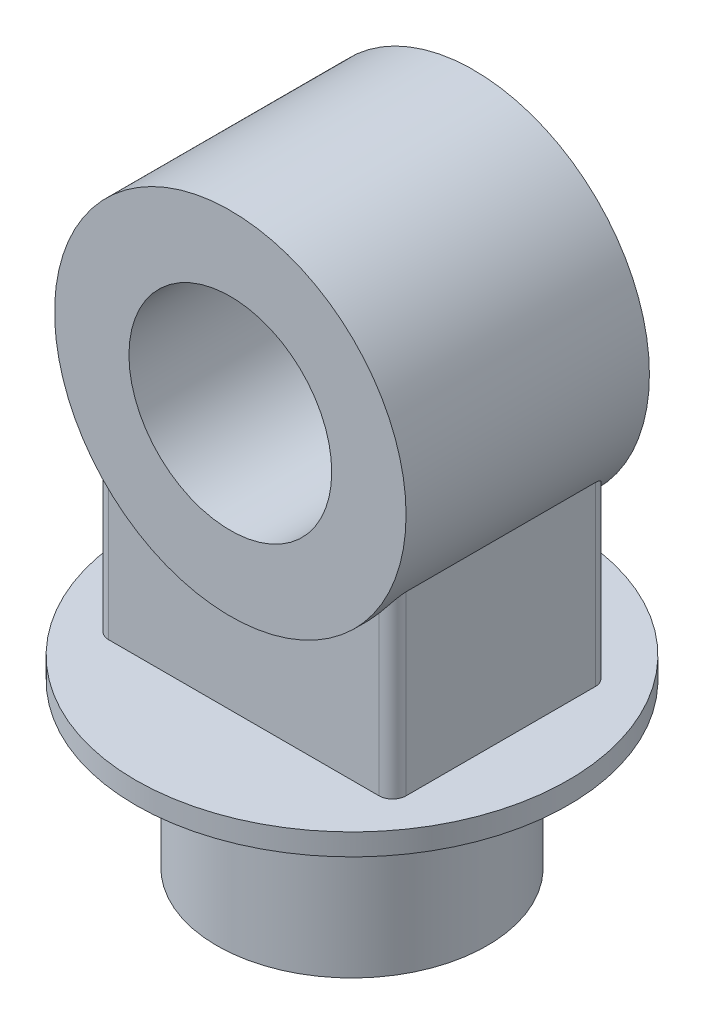
ISO-10303-21;
HEADER;
FILE_DESCRIPTION(('STEP AP214'),'2;1');
FILE_NAME('part.step','',(''),(''),'','','');
FILE_SCHEMA(('AUTOMOTIVE_DESIGN { 1 0 10303 214 1 1 1 1 }'));
ENDSEC;
DATA;
#1=APPLICATION_CONTEXT('core data for automotive mechanical design processes');
#2=APPLICATION_PROTOCOL_DEFINITION('international standard','automotive_design',2000,#1);
#3=PRODUCT_CONTEXT('',#1,'mechanical');
#4=PRODUCT('Part','Part','',(#3));
#5=PRODUCT_RELATED_PRODUCT_CATEGORY('part','',(#4));
#6=PRODUCT_DEFINITION_FORMATION('','',#4);
#7=PRODUCT_DEFINITION_CONTEXT('part definition',#1,'design');
#8=PRODUCT_DEFINITION('design','',#6,#7);
#9=PRODUCT_DEFINITION_SHAPE('','',#8);
#10=(LENGTH_UNIT() NAMED_UNIT(*) SI_UNIT(.MILLI.,.METRE.));
#11=(NAMED_UNIT(*) PLANE_ANGLE_UNIT() SI_UNIT($,.RADIAN.));
#12=(NAMED_UNIT(*) SI_UNIT($,.STERADIAN.) SOLID_ANGLE_UNIT());
#13=UNCERTAINTY_MEASURE_WITH_UNIT(LENGTH_MEASURE(1.E-05),#10,'distance_accuracy_value','');
#14=(GEOMETRIC_REPRESENTATION_CONTEXT(3) GLOBAL_UNCERTAINTY_ASSIGNED_CONTEXT((#13)) GLOBAL_UNIT_ASSIGNED_CONTEXT((#10,
#11,#12)) REPRESENTATION_CONTEXT('',''));
#15=CARTESIAN_POINT('',(0.,0.,0.));
#16=DIRECTION('',(0.,0.,1.));
#17=DIRECTION('',(1.,0.,0.));
#18=AXIS2_PLACEMENT_3D('',#15,#16,#17);
#19=CARTESIAN_POINT('',(0.,120.,0.));
#20=DIRECTION('',(0.,-1.,0.));
#21=DIRECTION('',(0.,0.,-1.));
#22=AXIS2_PLACEMENT_3D('',#19,#20,#21);
#23=CYLINDRICAL_SURFACE('',#22,100.);
#24=CARTESIAN_POINT('',(0.,120.,0.));
#25=DIRECTION('',(0.,1.,0.));
#26=DIRECTION('',(0.,0.,1.));
#27=AXIS2_PLACEMENT_3D('',#24,#25,#26);
#28=CIRCLE('',#27,100.);
#29=CARTESIAN_POINT('',(0.,120.,100.));
#30=VERTEX_POINT('',#29);
#31=EDGE_CURVE('E154',#30,#30,#28,.T.);
#32=ORIENTED_EDGE('',*,*,#31,.F.);
#33=EDGE_LOOP('',(#32));
#34=FACE_BOUND('',#33,.T.);
#35=CARTESIAN_POINT('',(0.,0.,0.));
#36=DIRECTION('',(0.,1.,0.));
#37=DIRECTION('',(0.,0.,1.));
#38=AXIS2_PLACEMENT_3D('',#35,#36,#37);
#39=CIRCLE('',#38,100.);
#40=CARTESIAN_POINT('',(0.,0.,100.));
#41=VERTEX_POINT('',#40);
#42=EDGE_CURVE('E247',#41,#41,#39,.T.);
#43=ORIENTED_EDGE('',*,*,#42,.T.);
#44=EDGE_LOOP('',(#43));
#45=FACE_BOUND('',#44,.T.);
#46=ADVANCED_FACE('F47',(#34,#45),#23,.T.);
#47=CARTESIAN_POINT('',(0.,0.,0.));
#48=DIRECTION('',(0.,1.,0.));
#49=DIRECTION('',(0.,0.,1.));
#50=AXIS2_PLACEMENT_3D('',#47,#48,#49);
#51=PLANE('',#50);
#52=ORIENTED_EDGE('',*,*,#42,.F.);
#53=EDGE_LOOP('',(#52));
#54=FACE_BOUND('',#53,.T.);
#55=ADVANCED_FACE('F259',(#54),#51,.F.);
#56=CARTESIAN_POINT('',(0.,136.,0.));
#57=DIRECTION('',(0.,-1.,0.));
#58=DIRECTION('',(0.,0.,-1.));
#59=AXIS2_PLACEMENT_3D('',#56,#57,#58);
#60=CYLINDRICAL_SURFACE('',#59,160.);
#61=CARTESIAN_POINT('',(0.,136.,0.));
#62=DIRECTION('',(0.,1.,0.));
#63=DIRECTION('',(0.,0.,1.));
#64=AXIS2_PLACEMENT_3D('',#61,#62,#63);
#65=CIRCLE('',#64,160.);
#66=CARTESIAN_POINT('',(0.,136.,160.));
#67=VERTEX_POINT('',#66);
#68=EDGE_CURVE('E243',#67,#67,#65,.T.);
#69=ORIENTED_EDGE('',*,*,#68,.F.);
#70=EDGE_LOOP('',(#69));
#71=FACE_BOUND('',#70,.T.);
#72=CARTESIAN_POINT('',(0.,120.,0.));
#73=DIRECTION('',(0.,1.,0.));
#74=DIRECTION('',(0.,0.,1.));
#75=AXIS2_PLACEMENT_3D('',#72,#73,#74);
#76=CIRCLE('',#75,160.);
#77=CARTESIAN_POINT('',(0.,120.,160.));
#78=VERTEX_POINT('',#77);
#79=EDGE_CURVE('E248',#78,#78,#76,.T.);
#80=ORIENTED_EDGE('',*,*,#79,.T.);
#81=EDGE_LOOP('',(#80));
#82=FACE_BOUND('',#81,.T.);
#83=ADVANCED_FACE('F261',(#71,#82),#60,.T.);
#84=CARTESIAN_POINT('',(0.,136.,0.));
#85=DIRECTION('',(0.,1.,0.));
#86=DIRECTION('',(0.,0.,1.));
#87=AXIS2_PLACEMENT_3D('',#84,#85,#86);
#88=PLANE('',#87);
#89=DIRECTION('',(0.,0.,-1.));
#90=VECTOR('',#89,1.);
#91=CARTESIAN_POINT('',(110.,136.,80.));
#92=LINE('',#91,#90);
#93=CARTESIAN_POINT('',(110.,136.,70.));
#94=VERTEX_POINT('',#93);
#95=CARTESIAN_POINT('',(110.,136.,-70.));
#96=VERTEX_POINT('',#95);
#97=EDGE_CURVE('E219',#94,#96,#92,.T.);
#98=ORIENTED_EDGE('',*,*,#97,.F.);
#99=CARTESIAN_POINT('',(100.,136.,70.));
#100=DIRECTION('',(0.,1.,0.));
#101=DIRECTION('',(0.,0.,1.));
#102=AXIS2_PLACEMENT_3D('',#99,#100,#101);
#103=CIRCLE('',#102,10.);
#104=CARTESIAN_POINT('',(100.,136.,80.));
#105=VERTEX_POINT('',#104);
#106=EDGE_CURVE('E132',#94,#105,#103,.F.);
#107=ORIENTED_EDGE('',*,*,#106,.T.);
#108=DIRECTION('',(1.,0.,0.));
#109=VECTOR('',#108,1.);
#110=CARTESIAN_POINT('',(-110.,136.,80.));
#111=LINE('',#110,#109);
#112=CARTESIAN_POINT('',(-100.,136.,80.));
#113=VERTEX_POINT('',#112);
#114=EDGE_CURVE('E217',#113,#105,#111,.T.);
#115=ORIENTED_EDGE('',*,*,#114,.F.);
#116=CARTESIAN_POINT('',(-100.,136.,70.));
#117=DIRECTION('',(0.,1.,0.));
#118=DIRECTION('',(0.,0.,1.));
#119=AXIS2_PLACEMENT_3D('',#116,#117,#118);
#120=CIRCLE('',#119,10.);
#121=CARTESIAN_POINT('',(-110.,136.,70.));
#122=VERTEX_POINT('',#121);
#123=EDGE_CURVE('E62',#113,#122,#120,.F.);
#124=ORIENTED_EDGE('',*,*,#123,.T.);
#125=DIRECTION('',(0.,0.,1.));
#126=VECTOR('',#125,1.);
#127=CARTESIAN_POINT('',(-110.,136.,80.));
#128=LINE('',#127,#126);
#129=CARTESIAN_POINT('',(-110.,136.,-70.));
#130=VERTEX_POINT('',#129);
#131=EDGE_CURVE('E227',#130,#122,#128,.T.);
#132=ORIENTED_EDGE('',*,*,#131,.F.);
#133=CARTESIAN_POINT('',(-100.,136.,-70.));
#134=DIRECTION('',(0.,1.,0.));
#135=DIRECTION('',(0.,0.,1.));
#136=AXIS2_PLACEMENT_3D('',#133,#134,#135);
#137=CIRCLE('',#136,10.);
#138=CARTESIAN_POINT('',(-100.,136.,-80.));
#139=VERTEX_POINT('',#138);
#140=EDGE_CURVE('E76',#130,#139,#137,.F.);
#141=ORIENTED_EDGE('',*,*,#140,.T.);
#142=DIRECTION('',(-1.,0.,0.));
#143=VECTOR('',#142,1.);
#144=CARTESIAN_POINT('',(-110.,136.,-80.));
#145=LINE('',#144,#143);
#146=CARTESIAN_POINT('',(100.,136.,-80.));
#147=VERTEX_POINT('',#146);
#148=EDGE_CURVE('E437',#147,#139,#145,.T.);
#149=ORIENTED_EDGE('',*,*,#148,.F.);
#150=CARTESIAN_POINT('',(100.,136.,-70.));
#151=DIRECTION('',(0.,1.,0.));
#152=DIRECTION('',(0.,0.,1.));
#153=AXIS2_PLACEMENT_3D('',#150,#151,#152);
#154=CIRCLE('',#153,10.);
#155=EDGE_CURVE('E133',#147,#96,#154,.F.);
#156=ORIENTED_EDGE('',*,*,#155,.T.);
#157=EDGE_LOOP('',(#98,#107,#115,#124,#132,#141,#149,#156));
#158=FACE_BOUND('',#157,.T.);
#159=ORIENTED_EDGE('',*,*,#68,.T.);
#160=EDGE_LOOP('',(#159));
#161=FACE_BOUND('',#160,.T.);
#162=ADVANCED_FACE('F215',(#158,#161),#88,.T.);
#163=CARTESIAN_POINT('',(0.,120.,0.));
#164=DIRECTION('',(0.,1.,0.));
#165=DIRECTION('',(0.,0.,1.));
#166=AXIS2_PLACEMENT_3D('',#163,#164,#165);
#167=PLANE('',#166);
#168=ORIENTED_EDGE('',*,*,#31,.T.);
#169=EDGE_LOOP('',(#168));
#170=FACE_BOUND('',#169,.T.);
#171=ORIENTED_EDGE('',*,*,#79,.F.);
#172=EDGE_LOOP('',(#171));
#173=FACE_BOUND('',#172,.T.);
#174=ADVANCED_FACE('F270',(#170,#173),#167,.F.);
#175=CARTESIAN_POINT('',(-110.,466.002,-80.));
#176=DIRECTION('',(0.,0.,1.));
#177=DIRECTION('',(1.,0.,0.));
#178=AXIS2_PLACEMENT_3D('',#175,#176,#177);
#179=PLANE('',#178);
#180=CARTESIAN_POINT('',(0.,336.,-80.));
#181=DIRECTION('',(0.,0.,1.));
#182=DIRECTION('',(1.,0.,0.));
#183=AXIS2_PLACEMENT_3D('',#180,#181,#182);
#184=CIRCLE('',#183,130.);
#185=CARTESIAN_POINT('',(100.,252.933761370819,-80.));
#186=VERTEX_POINT('',#185);
#187=CARTESIAN_POINT('',(-100.,252.933761370819,-80.));
#188=VERTEX_POINT('',#187);
#189=EDGE_CURVE('E124',#186,#188,#184,.F.);
#190=ORIENTED_EDGE('',*,*,#189,.F.);
#191=DIRECTION('',(0.,-1.,0.));
#192=VECTOR('',#191,1.);
#193=CARTESIAN_POINT('',(100.,466.002,-80.));
#194=LINE('',#193,#192);
#195=EDGE_CURVE('E139',#186,#147,#194,.T.);
#196=ORIENTED_EDGE('',*,*,#195,.T.);
#197=ORIENTED_EDGE('',*,*,#148,.T.);
#198=DIRECTION('',(0.,-1.,0.));
#199=VECTOR('',#198,1.);
#200=CARTESIAN_POINT('',(-100.,466.002,-80.));
#201=LINE('',#200,#199);
#202=EDGE_CURVE('E141',#139,#188,#201,.F.);
#203=ORIENTED_EDGE('',*,*,#202,.T.);
#204=EDGE_LOOP('',(#190,#196,#197,#203));
#205=FACE_BOUND('',#204,.T.);
#206=ADVANCED_FACE('F137',(#205),#179,.F.);
#207=CARTESIAN_POINT('',(110.,466.002,80.));
#208=DIRECTION('',(-1.,0.,0.));
#209=DIRECTION('',(0.,0.,1.));
#210=AXIS2_PLACEMENT_3D('',#207,#208,#209);
#211=PLANE('',#210);
#212=ORIENTED_EDGE('',*,*,#97,.T.);
#213=DIRECTION('',(0.,-1.,0.));
#214=VECTOR('',#213,1.);
#215=CARTESIAN_POINT('',(110.,466.002,-70.));
#216=LINE('',#215,#214);
#217=CARTESIAN_POINT('',(110.,266.717967697245,-70.));
#218=VERTEX_POINT('',#217);
#219=EDGE_CURVE('E152',#96,#218,#216,.F.);
#220=ORIENTED_EDGE('',*,*,#219,.T.);
#221=DIRECTION('',(0.,0.,-1.));
#222=VECTOR('',#221,1.);
#223=CARTESIAN_POINT('',(110.,266.717967697245,90.));
#224=LINE('',#223,#222);
#225=CARTESIAN_POINT('',(110.,266.717967697245,70.));
#226=VERTEX_POINT('',#225);
#227=EDGE_CURVE('E127',#226,#218,#224,.T.);
#228=ORIENTED_EDGE('',*,*,#227,.F.);
#229=DIRECTION('',(0.,-1.,0.));
#230=VECTOR('',#229,1.);
#231=CARTESIAN_POINT('',(110.,466.002,70.));
#232=LINE('',#231,#230);
#233=EDGE_CURVE('E147',#226,#94,#232,.T.);
#234=ORIENTED_EDGE('',*,*,#233,.T.);
#235=EDGE_LOOP('',(#212,#220,#228,#234));
#236=FACE_BOUND('',#235,.T.);
#237=ADVANCED_FACE('F232',(#236),#211,.F.);
#238=CARTESIAN_POINT('',(-110.,466.002,80.));
#239=DIRECTION('',(1.,0.,0.));
#240=DIRECTION('',(0.,0.,-1.));
#241=AXIS2_PLACEMENT_3D('',#238,#239,#240);
#242=PLANE('',#241);
#243=DIRECTION('',(0.,0.,-1.));
#244=VECTOR('',#243,1.);
#245=CARTESIAN_POINT('',(-110.,266.717967697245,90.));
#246=LINE('',#245,#244);
#247=CARTESIAN_POINT('',(-110.,266.717967697245,-69.9999999999999));
#248=VERTEX_POINT('',#247);
#249=CARTESIAN_POINT('',(-110.,266.717967697245,70.));
#250=VERTEX_POINT('',#249);
#251=EDGE_CURVE('E143',#248,#250,#246,.F.);
#252=ORIENTED_EDGE('',*,*,#251,.F.);
#253=DIRECTION('',(0.,-1.,0.));
#254=VECTOR('',#253,1.);
#255=CARTESIAN_POINT('',(-110.,466.002,-70.));
#256=LINE('',#255,#254);
#257=EDGE_CURVE('E170',#248,#130,#256,.T.);
#258=ORIENTED_EDGE('',*,*,#257,.T.);
#259=ORIENTED_EDGE('',*,*,#131,.T.);
#260=DIRECTION('',(0.,-1.,0.));
#261=VECTOR('',#260,1.);
#262=CARTESIAN_POINT('',(-110.,466.002,70.));
#263=LINE('',#262,#261);
#264=EDGE_CURVE('E167',#122,#250,#263,.F.);
#265=ORIENTED_EDGE('',*,*,#264,.T.);
#266=EDGE_LOOP('',(#252,#258,#259,#265));
#267=FACE_BOUND('',#266,.T.);
#268=ADVANCED_FACE('F278',(#267),#242,.F.);
#269=CARTESIAN_POINT('',(-110.,466.002,80.));
#270=DIRECTION('',(0.,0.,-1.));
#271=DIRECTION('',(-1.,0.,0.));
#272=AXIS2_PLACEMENT_3D('',#269,#270,#271);
#273=PLANE('',#272);
#274=ORIENTED_EDGE('',*,*,#114,.T.);
#275=DIRECTION('',(0.,-1.,0.));
#276=VECTOR('',#275,1.);
#277=CARTESIAN_POINT('',(100.,466.002,80.));
#278=LINE('',#277,#276);
#279=CARTESIAN_POINT('',(100.,252.933761370819,80.));
#280=VERTEX_POINT('',#279);
#281=EDGE_CURVE('E164',#105,#280,#278,.F.);
#282=ORIENTED_EDGE('',*,*,#281,.T.);
#283=CARTESIAN_POINT('',(0.,336.,80.));
#284=DIRECTION('',(0.,0.,-1.));
#285=DIRECTION('',(-1.,0.,0.));
#286=AXIS2_PLACEMENT_3D('',#283,#284,#285);
#287=CIRCLE('',#286,130.);
#288=CARTESIAN_POINT('',(-100.,252.933761370819,80.));
#289=VERTEX_POINT('',#288);
#290=EDGE_CURVE('E230',#289,#280,#287,.F.);
#291=ORIENTED_EDGE('',*,*,#290,.F.);
#292=DIRECTION('',(0.,-1.,0.));
#293=VECTOR('',#292,1.);
#294=CARTESIAN_POINT('',(-100.,466.002,80.));
#295=LINE('',#294,#293);
#296=EDGE_CURVE('E160',#289,#113,#295,.T.);
#297=ORIENTED_EDGE('',*,*,#296,.T.);
#298=EDGE_LOOP('',(#274,#282,#291,#297));
#299=FACE_BOUND('',#298,.T.);
#300=ADVANCED_FACE('F223',(#299),#273,.F.);
#301=CARTESIAN_POINT('',(0.,336.,90.));
#302=DIRECTION('',(0.,0.,-1.));
#303=DIRECTION('',(-1.,0.,0.));
#304=AXIS2_PLACEMENT_3D('',#301,#302,#303);
#305=CYLINDRICAL_SURFACE('',#304,130.);
#306=CARTESIAN_POINT('',(0.,336.,90.));
#307=DIRECTION('',(0.,0.,1.));
#308=DIRECTION('',(1.,0.,0.));
#309=AXIS2_PLACEMENT_3D('',#306,#307,#308);
#310=CIRCLE('',#309,130.);
#311=CARTESIAN_POINT('',(130.,336.,90.));
#312=VERTEX_POINT('',#311);
#313=EDGE_CURVE('E242',#312,#312,#310,.T.);
#314=ORIENTED_EDGE('',*,*,#313,.F.);
#315=EDGE_LOOP('',(#314));
#316=FACE_BOUND('',#315,.T.);
#317=CARTESIAN_POINT('',(0.,336.,-90.));
#318=DIRECTION('',(0.,0.,1.));
#319=DIRECTION('',(1.,0.,0.));
#320=AXIS2_PLACEMENT_3D('',#317,#318,#319);
#321=CIRCLE('',#320,130.);
#322=CARTESIAN_POINT('',(130.,336.,-90.));
#323=VERTEX_POINT('',#322);
#324=EDGE_CURVE('E442',#323,#323,#321,.T.);
#325=ORIENTED_EDGE('',*,*,#324,.T.);
#326=EDGE_LOOP('',(#325));
#327=FACE_BOUND('',#326,.T.);
#328=ORIENTED_EDGE('',*,*,#290,.T.);
#329=CARTESIAN_POINT('',(100.,252.933761370819,80.));
#330=CARTESIAN_POINT('',(100.223611151915,253.202952503255,79.9999830665315));
#331=CARTESIAN_POINT('',(100.446118360057,253.473036166024,79.9924995885085));
#332=CARTESIAN_POINT('',(100.888548742496,254.014496760122,79.9629173131463));
#333=CARTESIAN_POINT('',(101.108472043759,254.285873626978,79.9408192370116));
#334=CARTESIAN_POINT('',(101.545586290072,254.829711400373,79.8822979337703));
#335=CARTESIAN_POINT('',(101.76277446753,255.102173087004,79.8458612385231));
#336=CARTESIAN_POINT('',(102.193849033468,255.647413797012,79.7588609087488));
#337=CARTESIAN_POINT('',(102.407735374993,255.920192824843,79.7082970735217));
#338=CARTESIAN_POINT('',(103.048408055095,256.74400885936,79.5343891784366));
#339=CARTESIAN_POINT('',(103.469748368072,257.294974230618,79.3894263280958));
#340=CARTESIAN_POINT('',(104.088382224678,258.117224843771,79.1288060997197));
#341=CARTESIAN_POINT('',(104.292337034927,258.39057162742,79.0347525474724));
#342=CARTESIAN_POINT('',(104.695498702643,258.935304765081,78.8319429710981));
#343=CARTESIAN_POINT('',(104.894706004332,259.206691300842,78.7231883289499));
#344=CARTESIAN_POINT('',(105.336170271764,259.812965668139,78.4620472638272));
#345=CARTESIAN_POINT('',(105.577006541077,260.147108038148,78.3055009036513));
#346=CARTESIAN_POINT('',(106.04966094987,260.809343252621,77.967808626391));
#347=CARTESIAN_POINT('',(106.281479043935,261.137436066616,77.7866625854443));
#348=CARTESIAN_POINT('',(106.734152264033,261.784259610706,77.3986376161628));
#349=CARTESIAN_POINT('',(106.955036134368,262.103013877599,77.1918317878757));
#350=CARTESIAN_POINT('',(107.384708325122,262.728803605627,76.749894392022));
#351=CARTESIAN_POINT('',(107.593501627276,263.035843875289,76.5147746155492));
#352=CARTESIAN_POINT('',(107.921279015409,263.522080966666,76.1068757916445));
#353=CARTESIAN_POINT('',(108.044709884718,263.706240813682,75.9435605188262));
#354=CARTESIAN_POINT('',(108.284949666933,264.066582834907,75.6038296157538));
#355=CARTESIAN_POINT('',(108.401760304956,264.242767084986,75.4274174262628));
#356=CARTESIAN_POINT('',(108.627683741988,264.585236991633,75.0605773993746));
#357=CARTESIAN_POINT('',(108.736797961361,264.751524473746,74.8701521613913));
#358=CARTESIAN_POINT('',(108.945874410432,265.071634412635,74.4745306992528));
#359=CARTESIAN_POINT('',(109.04583974995,265.225461102935,74.2693395369045));
#360=CARTESIAN_POINT('',(109.274660386151,265.579056080623,73.7536743100227));
#361=CARTESIAN_POINT('',(109.398046362816,265.771031349643,73.4351396850743));
#362=CARTESIAN_POINT('',(109.561336457207,266.026263049992,72.9345418523036));
#363=CARTESIAN_POINT('',(109.612072269395,266.105785634321,72.7641622498837));
#364=CARTESIAN_POINT('',(109.705421847597,266.25239837099,72.4160328323222));
#365=CARTESIAN_POINT('',(109.748040656091,266.319496241142,72.2382876769633));
#366=CARTESIAN_POINT('',(109.820262744001,266.433384610412,71.8947331689276));
#367=CARTESIAN_POINT('',(109.850752312767,266.481551609067,71.729567610939));
#368=CARTESIAN_POINT('',(109.903691363628,266.565274678987,71.3948451418076));
#369=CARTESIAN_POINT('',(109.926143541964,266.600834979285,71.2252897238033));
#370=CARTESIAN_POINT('',(109.962659042777,266.658707696818,70.8807814271977));
#371=CARTESIAN_POINT('',(109.976613864032,266.680848750137,70.7057875562757));
#372=CARTESIAN_POINT('',(109.99061964662,266.703076138542,70.4419386674803));
#373=CARTESIAN_POINT('',(109.99413386492,266.708654625171,70.3536902139711));
#374=CARTESIAN_POINT('',(109.998824989492,266.716102079046,70.1769662160102));
#375=CARTESIAN_POINT('',(110.000001659485,266.717970671296,70.088490649507));
#376=CARTESIAN_POINT('',(110.,266.717967697245,70.));
#377=B_SPLINE_CURVE_WITH_KNOTS('',3,(#329,#330,#331,#332,#333,#334,#335,#336,#337,#338,#339,
#340,#341,#342,#343,#344,#345,#346,#347,#348,#349,#350,#351,#352,#353,#354,#355,#356,#357,#358,
#359,#360,#361,#362,#363,#364,#365,#366,#367,#368,#369,#370,#371,#372,#373,#374,#375,#376),
.UNSPECIFIED.,.F.,.F.,(4,2,2,2,2,2,2,2,2,2,2,2,2,2,2,2,2,2,2,2,2,2,2,4),(0.,1.04974156507783,
2.09943133114567,3.15010942417265,4.20080244462032,6.32356278933861,7.38465211465335,
8.44564176134501,9.76677685539399,11.087918601761,12.4053795382949,13.7222937149077,
14.5479419827464,15.3733741023698,16.1986534888325,17.0236513022889,18.1946866504919,
18.7783719827905,19.3616935243415,19.8852298594993,20.408590403038,20.9385006934629,
21.2038887699912,21.4693036704869),.UNSPECIFIED.);
#378=EDGE_CURVE('E196',#280,#226,#377,.T.);
#379=ORIENTED_EDGE('',*,*,#378,.T.);
#380=ORIENTED_EDGE('',*,*,#227,.T.);
#381=CARTESIAN_POINT('',(110.,266.717967697245,-70.));
#382=CARTESIAN_POINT('',(110.000033683462,266.718025852698,-70.1614230595313));
#383=CARTESIAN_POINT('',(109.996092792414,266.711764254296,-70.3228118197691));
#384=CARTESIAN_POINT('',(109.980519982779,266.687045880384,-70.6441123999957));
#385=CARTESIAN_POINT('',(109.968896213713,266.668602027069,-70.8040256031146));
#386=CARTESIAN_POINT('',(109.938376398954,266.620217986395,-71.1196424551221));
#387=CARTESIAN_POINT('',(109.919558261622,266.590400967593,-71.2753727040436));
#388=CARTESIAN_POINT('',(109.875071558334,266.52000006118,-71.5834085562726));
#389=CARTESIAN_POINT('',(109.849400846184,266.479412800404,-71.7357130704249));
#390=CARTESIAN_POINT('',(109.784772267017,266.377386983169,-72.0722520040974));
#391=CARTESIAN_POINT('',(109.744103525393,266.313281105856,-72.2553511890568));
#392=CARTESIAN_POINT('',(109.654040532803,266.17165023193,-72.6141464391851));
#393=CARTESIAN_POINT('',(109.604640075501,266.094115691273,-72.7898371277865));
#394=CARTESIAN_POINT('',(109.497968805892,265.927147418338,-73.133872391345));
#395=CARTESIAN_POINT('',(109.440667457039,265.837667562915,-73.302184951541));
#396=CARTESIAN_POINT('',(109.319341126161,265.648779195145,-73.6304969218558));
#397=CARTESIAN_POINT('',(109.25531768694,265.549372961282,-73.7904982269664));
#398=CARTESIAN_POINT('',(109.085069343255,265.28590129292,-74.1868876463209));
#399=CARTESIAN_POINT('',(108.974781990569,265.115997241409,-74.4176642111939));
#400=CARTESIAN_POINT('',(108.742772943656,264.76058359918,-74.8607110351426));
#401=CARTESIAN_POINT('',(108.621044869784,264.575065307649,-75.072970840064));
#402=CARTESIAN_POINT('',(108.36794946479,264.19164129378,-75.4804206329535));
#403=CARTESIAN_POINT('',(108.236568322626,263.993717884812,-75.6755852518652));
#404=CARTESIAN_POINT('',(107.965814499919,263.588382733387,-76.0497203250662));
#405=CARTESIAN_POINT('',(107.826442440892,263.380971729107,-76.2286920360201));
#406=CARTESIAN_POINT('',(107.56145650763,262.989174407744,-76.5468161797372));
#407=CARTESIAN_POINT('',(107.436764821801,262.805791987749,-76.6879854690674));
#408=CARTESIAN_POINT('',(107.182869679799,262.434497987953,-76.9599552926783));
#409=CARTESIAN_POINT('',(107.053665586411,262.24658576965,-77.0907543539386));
#410=CARTESIAN_POINT('',(106.659844344167,261.677121003612,-77.4685356621902));
#411=CARTESIAN_POINT('',(106.389102445143,261.289965080353,-77.7008024816961));
#412=CARTESIAN_POINT('',(105.833418194947,260.504836154638,-78.129863631631));
#413=CARTESIAN_POINT('',(105.548442441802,260.106838810795,-78.3265689888296));
#414=CARTESIAN_POINT('',(104.96676628824,259.304344779382,-78.6860846955171));
#415=CARTESIAN_POINT('',(104.670068038633,258.899849292081,-78.8489012287858));
#416=CARTESIAN_POINT('',(104.024574509401,258.030646711215,-79.1623550419402));
#417=CARTESIAN_POINT('',(103.674248758637,257.565348460988,-79.3081944572228));
#418=CARTESIAN_POINT('',(102.961876677953,256.632523338709,-79.558756520093));
#419=CARTESIAN_POINT('',(102.599828734006,256.16499616738,-79.6634734792563));
#420=CARTESIAN_POINT('',(102.051092736822,255.466397204689,-79.7891645729388));
#421=CARTESIAN_POINT('',(101.868137468165,255.235094848973,-79.8257282191264));
#422=CARTESIAN_POINT('',(101.499966150616,254.77288550036,-79.8886289353229));
#423=CARTESIAN_POINT('',(101.314750133026,254.541978502041,-79.9149661467555));
#424=CARTESIAN_POINT('',(100.942320486513,254.080919722901,-79.9572665465168));
#425=CARTESIAN_POINT('',(100.755107350153,253.850767773367,-79.9732322353467));
#426=CARTESIAN_POINT('',(100.378860262163,253.391449185777,-79.9945948234744));
#427=CARTESIAN_POINT('',(100.189826234412,253.162282589497,-79.9999912789888));
#428=CARTESIAN_POINT('',(100.,252.933761370819,-80.));
#429=B_SPLINE_CURVE_WITH_KNOTS('',3,(#381,#382,#383,#384,#385,#386,#387,#388,#389,#390,#391,
#392,#393,#394,#395,#396,#397,#398,#399,#400,#401,#402,#403,#404,#405,#406,#407,#408,#409,#410,
#411,#412,#413,#414,#415,#416,#417,#418,#419,#420,#421,#422,#423,#424,#425,#426,#427,#428),
.UNSPECIFIED.,.F.,.F.,(4,2,2,2,2,2,2,2,2,2,2,2,2,2,2,2,2,2,2,2,2,2,2,4),(0.,0.484045005923069,
0.967577389145413,1.44601544684509,1.92460352520314,2.51835043890467,3.11252108624072,
3.7090561398874,4.30545457926273,5.22516595363376,6.14539326092329,7.06696382284195,
7.98846280401965,8.77680092000541,9.56525081419904,11.1426900482287,12.7240229357798,
14.305067020047,16.1047501551828,17.9046821508917,18.7960435003637,19.6873925225409,
20.5785265668948,21.4696980275819),.UNSPECIFIED.);
#430=EDGE_CURVE('E120',#218,#186,#429,.T.);
#431=ORIENTED_EDGE('',*,*,#430,.T.);
#432=ORIENTED_EDGE('',*,*,#189,.T.);
#433=CARTESIAN_POINT('',(-100.,252.933761370819,-80.));
#434=CARTESIAN_POINT('',(-100.223611151915,253.202952503255,-79.9999830665314));
#435=CARTESIAN_POINT('',(-100.446118360057,253.473036166024,-79.9924995885084));
#436=CARTESIAN_POINT('',(-100.888548742496,254.014496760122,-79.9629173131462));
#437=CARTESIAN_POINT('',(-101.10847204376,254.285873626978,-79.9408192370115));
#438=CARTESIAN_POINT('',(-101.545586290072,254.829711400373,-79.8822979337703));
#439=CARTESIAN_POINT('',(-101.76277446753,255.102173087004,-79.8458612385231));
#440=CARTESIAN_POINT('',(-102.193849033468,255.647413797012,-79.7588609087487));
#441=CARTESIAN_POINT('',(-102.407735374993,255.920192824843,-79.7082970735217));
#442=CARTESIAN_POINT('',(-103.048408055095,256.74400885936,-79.5343891784366));
#443=CARTESIAN_POINT('',(-103.469748368072,257.294974230618,-79.3894263280957));
#444=CARTESIAN_POINT('',(-104.088382224678,258.117224843771,-79.1288060997197));
#445=CARTESIAN_POINT('',(-104.292337034927,258.39057162742,-79.0347525474724));
#446=CARTESIAN_POINT('',(-104.695498702643,258.935304765081,-78.8319429710981));
#447=CARTESIAN_POINT('',(-104.894706004332,259.206691300842,-78.7231883289498));
#448=CARTESIAN_POINT('',(-105.336170271764,259.812965668139,-78.4620472638272));
#449=CARTESIAN_POINT('',(-105.577006541077,260.147108038148,-78.3055009036512));
#450=CARTESIAN_POINT('',(-106.04966094987,260.809343252621,-77.9678086263909));
#451=CARTESIAN_POINT('',(-106.281479043935,261.137436066616,-77.7866625854443));
#452=CARTESIAN_POINT('',(-106.734152264033,261.784259610706,-77.3986376161628));
#453=CARTESIAN_POINT('',(-106.955036134368,262.103013877599,-77.1918317878757));
#454=CARTESIAN_POINT('',(-107.384708325122,262.728803605627,-76.749894392022));
#455=CARTESIAN_POINT('',(-107.593501627276,263.035843875289,-76.5147746155492));
#456=CARTESIAN_POINT('',(-107.921279015409,263.522080966666,-76.1068757916445));
#457=CARTESIAN_POINT('',(-108.044709884718,263.706240813682,-75.9435605188262));
#458=CARTESIAN_POINT('',(-108.284949666933,264.066582834907,-75.6038296157538));
#459=CARTESIAN_POINT('',(-108.401760304956,264.242767084986,-75.4274174262628));
#460=CARTESIAN_POINT('',(-108.627683741988,264.585236991633,-75.0605773993745));
#461=CARTESIAN_POINT('',(-108.736797961361,264.751524473746,-74.8701521613912));
#462=CARTESIAN_POINT('',(-108.945874410432,265.071634412635,-74.4745306992527));
#463=CARTESIAN_POINT('',(-109.04583974995,265.225461102935,-74.2693395369044));
#464=CARTESIAN_POINT('',(-109.274660386151,265.579056080623,-73.7536743100226));
#465=CARTESIAN_POINT('',(-109.398046362816,265.771031349643,-73.4351396850741));
#466=CARTESIAN_POINT('',(-109.561336457207,266.026263049992,-72.9345418523035));
#467=CARTESIAN_POINT('',(-109.612072269395,266.105785634321,-72.7641622498836));
#468=CARTESIAN_POINT('',(-109.705421847597,266.25239837099,-72.4160328323222));
#469=CARTESIAN_POINT('',(-109.748040656091,266.319496241142,-72.2382876769632));
#470=CARTESIAN_POINT('',(-109.820262744001,266.433384610412,-71.8947331689276));
#471=CARTESIAN_POINT('',(-109.850752312767,266.481551609067,-71.7295676109389));
#472=CARTESIAN_POINT('',(-109.903691363628,266.565274678988,-71.3948451418075));
#473=CARTESIAN_POINT('',(-109.926143541964,266.600834979285,-71.2252897238032));
#474=CARTESIAN_POINT('',(-109.962659042777,266.658707696818,-70.8807814271977));
#475=CARTESIAN_POINT('',(-109.976613864032,266.680848750137,-70.7057875562756));
#476=CARTESIAN_POINT('',(-109.99061964662,266.703076138542,-70.4419386674802));
#477=CARTESIAN_POINT('',(-109.99413386492,266.708654625172,-70.353690213971));
#478=CARTESIAN_POINT('',(-109.998824989492,266.716102079046,-70.1769662160102));
#479=CARTESIAN_POINT('',(-110.000001659485,266.717970671296,-70.088490649507));
#480=CARTESIAN_POINT('',(-110.,266.717967697245,-70.));
#481=B_SPLINE_CURVE_WITH_KNOTS('',3,(#433,#434,#435,#436,#437,#438,#439,#440,#441,#442,#443,
#444,#445,#446,#447,#448,#449,#450,#451,#452,#453,#454,#455,#456,#457,#458,#459,#460,#461,#462,
#463,#464,#465,#466,#467,#468,#469,#470,#471,#472,#473,#474,#475,#476,#477,#478,#479,#480),
.UNSPECIFIED.,.F.,.F.,(4,2,2,2,2,2,2,2,2,2,2,2,2,2,2,2,2,2,2,2,2,2,2,4),(0.,1.04974156507778,
2.09943133114574,3.15010942417272,4.20080244462032,6.32356278933855,7.38465211465329,
8.44564176134495,9.76677685539391,11.0879186017609,12.4053795382948,13.7222937149076,
14.5479419827464,15.3733741023698,16.1986534888326,17.023651302289,18.194686650492,
18.7783719827905,19.3616935243415,19.8852298594992,20.4085904030381,20.9385006934629,
21.2038887699912,21.4693036704869),.UNSPECIFIED.);
#482=EDGE_CURVE('E205',#188,#248,#481,.T.);
#483=ORIENTED_EDGE('',*,*,#482,.T.);
#484=ORIENTED_EDGE('',*,*,#251,.T.);
#485=CARTESIAN_POINT('',(-110.,266.717967697245,70.));
#486=CARTESIAN_POINT('',(-110.000033683462,266.718025852698,70.1614230595313));
#487=CARTESIAN_POINT('',(-109.996092792414,266.711764254296,70.322811819769));
#488=CARTESIAN_POINT('',(-109.980519982779,266.687045880384,70.6441123999957));
#489=CARTESIAN_POINT('',(-109.968896213713,266.668602027069,70.8040256031146));
#490=CARTESIAN_POINT('',(-109.938376398954,266.620217986395,71.119642455122));
#491=CARTESIAN_POINT('',(-109.919558261622,266.590400967593,71.2753727040436));
#492=CARTESIAN_POINT('',(-109.875071558334,266.52000006118,71.5834085562726));
#493=CARTESIAN_POINT('',(-109.849400846184,266.479412800404,71.7357130704249));
#494=CARTESIAN_POINT('',(-109.784772267017,266.377386983169,72.0722520040974));
#495=CARTESIAN_POINT('',(-109.744103525393,266.313281105856,72.2553511890567));
#496=CARTESIAN_POINT('',(-109.654040532803,266.17165023193,72.614146439185));
#497=CARTESIAN_POINT('',(-109.604640075501,266.094115691273,72.7898371277864));
#498=CARTESIAN_POINT('',(-109.497968805892,265.927147418338,73.133872391345));
#499=CARTESIAN_POINT('',(-109.440667457039,265.837667562915,73.302184951541));
#500=CARTESIAN_POINT('',(-109.319341126161,265.648779195145,73.6304969218558));
#501=CARTESIAN_POINT('',(-109.25531768694,265.549372961282,73.7904982269663));
#502=CARTESIAN_POINT('',(-109.085069343255,265.28590129292,74.1868876463209));
#503=CARTESIAN_POINT('',(-108.974781990569,265.115997241409,74.4176642111939));
#504=CARTESIAN_POINT('',(-108.742772943656,264.76058359918,74.8607110351426));
#505=CARTESIAN_POINT('',(-108.621044869784,264.575065307649,75.0729708400639));
#506=CARTESIAN_POINT('',(-108.36794946479,264.19164129378,75.4804206329534));
#507=CARTESIAN_POINT('',(-108.236568322626,263.993717884812,75.6755852518652));
#508=CARTESIAN_POINT('',(-107.965814499919,263.588382733388,76.0497203250661));
#509=CARTESIAN_POINT('',(-107.826442440892,263.380971729107,76.2286920360201));
#510=CARTESIAN_POINT('',(-107.56145650763,262.989174407744,76.5468161797372));
#511=CARTESIAN_POINT('',(-107.436764821801,262.805791987749,76.6879854690673));
#512=CARTESIAN_POINT('',(-107.182869679799,262.434497987953,76.9599552926783));
#513=CARTESIAN_POINT('',(-107.053665586411,262.24658576965,77.0907543539385));
#514=CARTESIAN_POINT('',(-106.659844344167,261.677121003612,77.4685356621901));
#515=CARTESIAN_POINT('',(-106.389102445143,261.289965080353,77.700802481696));
#516=CARTESIAN_POINT('',(-105.833418194947,260.504836154638,78.1298636316309));
#517=CARTESIAN_POINT('',(-105.548442441802,260.106838810795,78.3265689888295));
#518=CARTESIAN_POINT('',(-104.96676628824,259.304344779382,78.6860846955171));
#519=CARTESIAN_POINT('',(-104.670068038633,258.899849292081,78.8489012287858));
#520=CARTESIAN_POINT('',(-104.024574509401,258.030646711215,79.1623550419402));
#521=CARTESIAN_POINT('',(-103.674248758637,257.565348460988,79.3081944572228));
#522=CARTESIAN_POINT('',(-102.961876677953,256.632523338709,79.5587565200929));
#523=CARTESIAN_POINT('',(-102.599828734006,256.16499616738,79.6634734792563));
#524=CARTESIAN_POINT('',(-102.051092736822,255.466397204689,79.7891645729387));
#525=CARTESIAN_POINT('',(-101.868137468165,255.235094848973,79.8257282191264));
#526=CARTESIAN_POINT('',(-101.499966150616,254.77288550036,79.8886289353228));
#527=CARTESIAN_POINT('',(-101.314750133026,254.541978502041,79.9149661467554));
#528=CARTESIAN_POINT('',(-100.942320486513,254.080919722901,79.9572665465167));
#529=CARTESIAN_POINT('',(-100.755107350153,253.850767773367,79.9732322353467));
#530=CARTESIAN_POINT('',(-100.378860262163,253.391449185777,79.9945948234743));
#531=CARTESIAN_POINT('',(-100.189826234412,253.162282589497,79.9999912789887));
#532=CARTESIAN_POINT('',(-100.,252.933761370819,80.));
#533=B_SPLINE_CURVE_WITH_KNOTS('',3,(#485,#486,#487,#488,#489,#490,#491,#492,#493,#494,#495,
#496,#497,#498,#499,#500,#501,#502,#503,#504,#505,#506,#507,#508,#509,#510,#511,#512,#513,#514,
#515,#516,#517,#518,#519,#520,#521,#522,#523,#524,#525,#526,#527,#528,#529,#530,#531,#532),
.UNSPECIFIED.,.F.,.F.,(4,2,2,2,2,2,2,2,2,2,2,2,2,2,2,2,2,2,2,2,2,2,2,4),(0.,0.484045005923086,
0.967577389145422,1.44601544684507,1.92460352520313,2.51835043890468,3.11252108624077,
3.70905613988741,4.30545457926274,5.22516595363374,6.14539326092329,7.06696382284192,
7.98846280401962,8.7768009200054,9.56525081419893,11.1426900482287,12.7240229357797,
14.305067020047,16.1047501551828,17.9046821508918,18.7960435003638,19.6873925225409,
20.5785265668947,21.4696980275819),.UNSPECIFIED.);
#534=EDGE_CURVE('E12',#250,#289,#533,.T.);
#535=ORIENTED_EDGE('',*,*,#534,.T.);
#536=EDGE_LOOP('',(#328,#379,#380,#431,#432,#483,#484,#535));
#537=FACE_BOUND('',#536,.T.);
#538=ADVANCED_FACE('F123',(#316,#327,#537),#305,.T.);
#539=CARTESIAN_POINT('',(0.,336.,90.));
#540=DIRECTION('',(0.,0.,1.));
#541=DIRECTION('',(1.,0.,0.));
#542=AXIS2_PLACEMENT_3D('',#539,#540,#541);
#543=PLANE('',#542);
#544=ORIENTED_EDGE('',*,*,#313,.T.);
#545=EDGE_LOOP('',(#544));
#546=FACE_BOUND('',#545,.T.);
#547=CARTESIAN_POINT('',(0.,336.,90.));
#548=DIRECTION('',(0.,0.,1.));
#549=DIRECTION('',(1.,0.,0.));
#550=AXIS2_PLACEMENT_3D('',#547,#548,#549);
#551=CIRCLE('',#550,75.);
#552=CARTESIAN_POINT('',(-75.,336.,90.));
#553=VERTEX_POINT('',#552);
#554=EDGE_CURVE('E447',#553,#553,#551,.T.);
#555=ORIENTED_EDGE('',*,*,#554,.F.);
#556=EDGE_LOOP('',(#555));
#557=FACE_BOUND('',#556,.T.);
#558=ADVANCED_FACE('F307',(#546,#557),#543,.T.);
#559=CARTESIAN_POINT('',(0.,336.,-90.));
#560=DIRECTION('',(0.,0.,1.));
#561=DIRECTION('',(1.,0.,0.));
#562=AXIS2_PLACEMENT_3D('',#559,#560,#561);
#563=PLANE('',#562);
#564=ORIENTED_EDGE('',*,*,#324,.F.);
#565=EDGE_LOOP('',(#564));
#566=FACE_BOUND('',#565,.T.);
#567=CARTESIAN_POINT('',(0.,336.,-90.));
#568=DIRECTION('',(0.,0.,1.));
#569=DIRECTION('',(1.,0.,0.));
#570=AXIS2_PLACEMENT_3D('',#567,#568,#569);
#571=CIRCLE('',#570,75.);
#572=CARTESIAN_POINT('',(-75.,336.,-90.));
#573=VERTEX_POINT('',#572);
#574=EDGE_CURVE('E451',#573,#573,#571,.T.);
#575=ORIENTED_EDGE('',*,*,#574,.T.);
#576=EDGE_LOOP('',(#575));
#577=FACE_BOUND('',#576,.T.);
#578=ADVANCED_FACE('F315',(#566,#577),#563,.F.);
#579=CARTESIAN_POINT('',(0.,336.,90.));
#580=DIRECTION('',(0.,0.,-1.));
#581=DIRECTION('',(-1.,0.,0.));
#582=AXIS2_PLACEMENT_3D('',#579,#580,#581);
#583=CYLINDRICAL_SURFACE('',#582,75.);
#584=CARTESIAN_POINT('',(-75.,336.,90.));
#585=CARTESIAN_POINT('',(-75.,336.,88.125));
#586=CARTESIAN_POINT('',(-75.,336.,86.25));
#587=CARTESIAN_POINT('',(-75.,336.,82.5));
#588=CARTESIAN_POINT('',(-75.,336.,80.625));
#589=CARTESIAN_POINT('',(-75.,336.,76.875));
#590=CARTESIAN_POINT('',(-75.,336.,75.));
#591=CARTESIAN_POINT('',(-75.,336.,71.25));
#592=CARTESIAN_POINT('',(-75.,336.,69.375));
#593=CARTESIAN_POINT('',(-75.,336.,65.625));
#594=CARTESIAN_POINT('',(-75.,336.,63.75));
#595=CARTESIAN_POINT('',(-75.,336.,60.));
#596=CARTESIAN_POINT('',(-75.,336.,58.125));
#597=CARTESIAN_POINT('',(-75.,336.,54.375));
#598=CARTESIAN_POINT('',(-75.,336.,52.5));
#599=CARTESIAN_POINT('',(-75.,336.,48.75));
#600=CARTESIAN_POINT('',(-75.,336.,46.875));
#601=CARTESIAN_POINT('',(-75.,336.,43.125));
#602=CARTESIAN_POINT('',(-75.,336.,41.25));
#603=CARTESIAN_POINT('',(-75.,336.,37.5));
#604=CARTESIAN_POINT('',(-75.,336.,35.625));
#605=CARTESIAN_POINT('',(-75.,336.,31.875));
#606=CARTESIAN_POINT('',(-75.,336.,30.));
#607=CARTESIAN_POINT('',(-75.,336.,26.25));
#608=CARTESIAN_POINT('',(-75.,336.,24.375));
#609=CARTESIAN_POINT('',(-75.,336.,20.625));
#610=CARTESIAN_POINT('',(-75.,336.,18.75));
#611=CARTESIAN_POINT('',(-75.,336.,15.));
#612=CARTESIAN_POINT('',(-75.,336.,13.125));
#613=CARTESIAN_POINT('',(-75.,336.,9.37499999999998));
#614=CARTESIAN_POINT('',(-75.,336.,7.49999999999998));
#615=CARTESIAN_POINT('',(-75.,336.,3.74999999999998));
#616=CARTESIAN_POINT('',(-75.,336.,1.87499999999997));
#617=CARTESIAN_POINT('',(-75.,336.,-1.87500000000003));
#618=CARTESIAN_POINT('',(-75.,336.,-3.75000000000003));
#619=CARTESIAN_POINT('',(-75.,336.,-7.50000000000003));
#620=CARTESIAN_POINT('',(-75.,336.,-9.37500000000004));
#621=CARTESIAN_POINT('',(-75.,336.,-13.125));
#622=CARTESIAN_POINT('',(-75.,336.,-15.));
#623=CARTESIAN_POINT('',(-75.,336.,-18.75));
#624=CARTESIAN_POINT('',(-75.,336.,-20.625));
#625=CARTESIAN_POINT('',(-75.,336.,-24.375));
#626=CARTESIAN_POINT('',(-75.,336.,-26.25));
#627=CARTESIAN_POINT('',(-75.,336.,-30.));
#628=CARTESIAN_POINT('',(-75.,336.,-31.875));
#629=CARTESIAN_POINT('',(-75.,336.,-35.625));
#630=CARTESIAN_POINT('',(-75.,336.,-37.5));
#631=CARTESIAN_POINT('',(-75.,336.,-41.25));
#632=CARTESIAN_POINT('',(-75.,336.,-43.125));
#633=CARTESIAN_POINT('',(-75.,336.,-46.875));
#634=CARTESIAN_POINT('',(-75.,336.,-48.75));
#635=CARTESIAN_POINT('',(-75.,336.,-52.5));
#636=CARTESIAN_POINT('',(-75.,336.,-54.375));
#637=CARTESIAN_POINT('',(-75.,336.,-58.125));
#638=CARTESIAN_POINT('',(-75.,336.,-60.));
#639=CARTESIAN_POINT('',(-75.,336.,-63.75));
#640=CARTESIAN_POINT('',(-75.,336.,-65.625));
#641=CARTESIAN_POINT('',(-75.,336.,-69.375));
#642=CARTESIAN_POINT('',(-75.,336.,-71.25));
#643=CARTESIAN_POINT('',(-75.,336.,-75.));
#644=CARTESIAN_POINT('',(-75.,336.,-76.875));
#645=CARTESIAN_POINT('',(-75.,336.,-80.625));
#646=CARTESIAN_POINT('',(-75.,336.,-82.5));
#647=CARTESIAN_POINT('',(-75.,336.,-86.25));
#648=CARTESIAN_POINT('',(-75.,336.,-88.125));
#649=CARTESIAN_POINT('',(-75.,336.,-90.));
#650=B_SPLINE_CURVE_WITH_KNOTS('',3,(#584,#585,#586,#587,#588,#589,#590,#591,#592,#593,#594,
#595,#596,#597,#598,#599,#600,#601,#602,#603,#604,#605,#606,#607,#608,#609,#610,#611,#612,#613,
#614,#615,#616,#617,#618,#619,#620,#621,#622,#623,#624,#625,#626,#627,#628,#629,#630,#631,#632,
#633,#634,#635,#636,#637,#638,#639,#640,#641,#642,#643,#644,#645,#646,#647,#648,#649),
.UNSPECIFIED.,.F.,.F.,(4,2,2,2,2,2,2,2,2,2,2,2,2,2,2,2,2,2,2,2,2,2,2,2,2,2,2,2,2,2,2,2,4),(0.,
5.62499999999999,11.25,16.875,22.5,28.125,33.75,39.375,45.,50.625,56.25,61.875,67.5,73.125,
78.75,84.375,90.,95.625,101.25,106.875,112.5,118.125,123.75,129.375,135.,140.625,146.25,151.875,
157.5,163.125,168.75,174.375,180.),.UNSPECIFIED.);
#651=EDGE_CURVE('BSEAM189',#553,#573,#650,.T.);
#652=ORIENTED_EDGE('',*,*,#554,.T.);
#653=ORIENTED_EDGE('',*,*,#574,.F.);
#654=ORIENTED_EDGE('',*,*,#651,.T.);
#655=ORIENTED_EDGE('',*,*,#651,.F.);
#656=EDGE_LOOP('',(#652,#654,#653,#655));
#657=FACE_BOUND('',#656,.T.);
#658=ADVANCED_FACE('F189',(#657),#583,.F.);
#659=CARTESIAN_POINT('',(100.,466.002,-70.));
#660=DIRECTION('',(0.,-1.,0.));
#661=DIRECTION('',(0.,0.,-1.));
#662=AXIS2_PLACEMENT_3D('',#659,#660,#661);
#663=CYLINDRICAL_SURFACE('',#662,10.);
#664=ORIENTED_EDGE('',*,*,#430,.F.);
#665=ORIENTED_EDGE('',*,*,#219,.F.);
#666=ORIENTED_EDGE('',*,*,#155,.F.);
#667=ORIENTED_EDGE('',*,*,#195,.F.);
#668=EDGE_LOOP('',(#664,#665,#666,#667));
#669=FACE_BOUND('',#668,.T.);
#670=ADVANCED_FACE('F145',(#669),#663,.T.);
#671=CARTESIAN_POINT('',(100.,466.002,70.));
#672=DIRECTION('',(0.,-1.,0.));
#673=DIRECTION('',(0.,0.,-1.));
#674=AXIS2_PLACEMENT_3D('',#671,#672,#673);
#675=CYLINDRICAL_SURFACE('',#674,10.);
#676=ORIENTED_EDGE('',*,*,#378,.F.);
#677=ORIENTED_EDGE('',*,*,#281,.F.);
#678=ORIENTED_EDGE('',*,*,#106,.F.);
#679=ORIENTED_EDGE('',*,*,#233,.F.);
#680=EDGE_LOOP('',(#676,#677,#678,#679));
#681=FACE_BOUND('',#680,.T.);
#682=ADVANCED_FACE('F188',(#681),#675,.T.);
#683=CARTESIAN_POINT('',(-100.,466.002,-70.));
#684=DIRECTION('',(0.,-1.,0.));
#685=DIRECTION('',(0.,0.,-1.));
#686=AXIS2_PLACEMENT_3D('',#683,#684,#685);
#687=CYLINDRICAL_SURFACE('',#686,10.);
#688=ORIENTED_EDGE('',*,*,#482,.F.);
#689=ORIENTED_EDGE('',*,*,#202,.F.);
#690=ORIENTED_EDGE('',*,*,#140,.F.);
#691=ORIENTED_EDGE('',*,*,#257,.F.);
#692=EDGE_LOOP('',(#688,#689,#690,#691));
#693=FACE_BOUND('',#692,.T.);
#694=ADVANCED_FACE('F193',(#693),#687,.T.);
#695=CARTESIAN_POINT('',(-100.,466.002,70.));
#696=DIRECTION('',(0.,-1.,0.));
#697=DIRECTION('',(0.,0.,-1.));
#698=AXIS2_PLACEMENT_3D('',#695,#696,#697);
#699=CYLINDRICAL_SURFACE('',#698,10.);
#700=ORIENTED_EDGE('',*,*,#534,.F.);
#701=ORIENTED_EDGE('',*,*,#264,.F.);
#702=ORIENTED_EDGE('',*,*,#123,.F.);
#703=ORIENTED_EDGE('',*,*,#296,.F.);
#704=EDGE_LOOP('',(#700,#701,#702,#703));
#705=FACE_BOUND('',#704,.T.);
#706=ADVANCED_FACE('F49',(#705),#699,.T.);
#707=CLOSED_SHELL('',(#46,#55,#83,#162,#174,#206,#237,#268,#300,#538,#558,#578,#658,#670,#682,
#694,#706));
#708=MANIFOLD_SOLID_BREP('B2',#707);
#709=ADVANCED_BREP_SHAPE_REPRESENTATION('',(#18,#708),#14);
#710=SHAPE_DEFINITION_REPRESENTATION(#9,#709);
ENDSEC;
END-ISO-10303-21;
